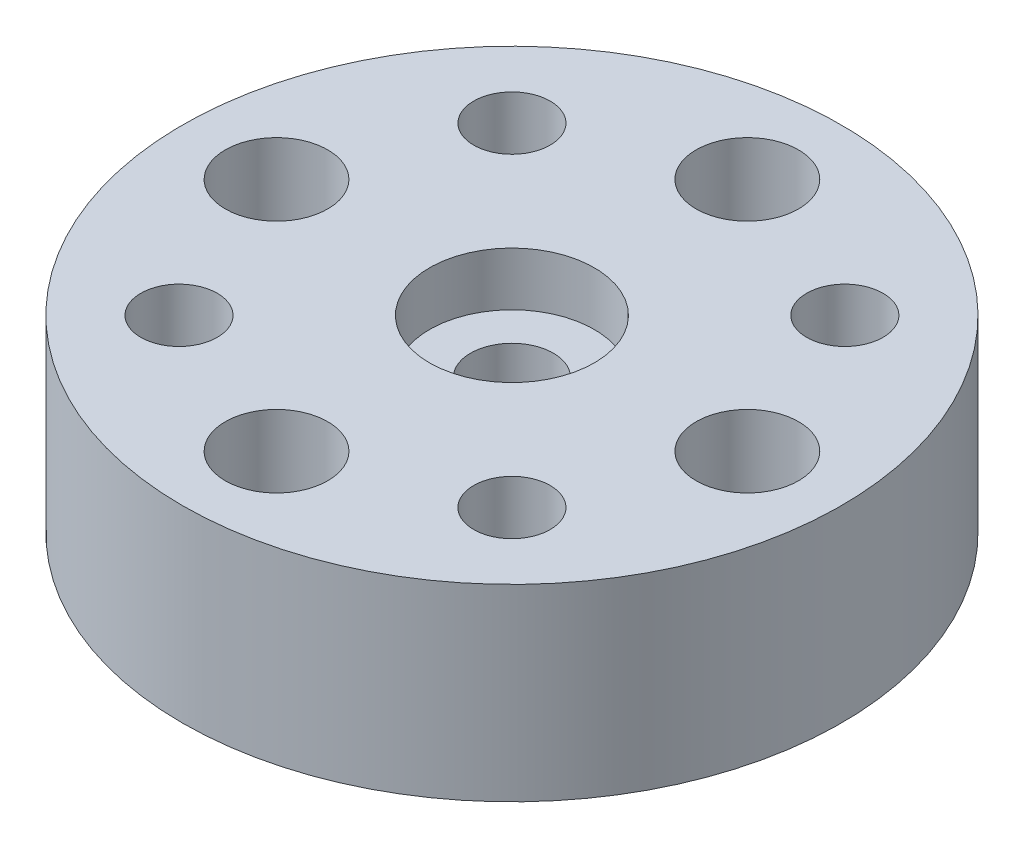
ISO-10303-21;
HEADER;
FILE_DESCRIPTION(('STEP AP214'),'2;1');
FILE_NAME('part.step','',(''),(''),'','','');
FILE_SCHEMA(('AUTOMOTIVE_DESIGN { 1 0 10303 214 1 1 1 1 }'));
ENDSEC;
DATA;
#1=APPLICATION_CONTEXT('core data for automotive mechanical design processes');
#2=APPLICATION_PROTOCOL_DEFINITION('international standard','automotive_design',2000,#1);
#3=PRODUCT_CONTEXT('',#1,'mechanical');
#4=PRODUCT('Part','Part','',(#3));
#5=PRODUCT_RELATED_PRODUCT_CATEGORY('part','',(#4));
#6=PRODUCT_DEFINITION_FORMATION('','',#4);
#7=PRODUCT_DEFINITION_CONTEXT('part definition',#1,'design');
#8=PRODUCT_DEFINITION('design','',#6,#7);
#9=PRODUCT_DEFINITION_SHAPE('','',#8);
#10=(LENGTH_UNIT() NAMED_UNIT(*) SI_UNIT(.MILLI.,.METRE.));
#11=(NAMED_UNIT(*) PLANE_ANGLE_UNIT() SI_UNIT($,.RADIAN.));
#12=(NAMED_UNIT(*) SI_UNIT($,.STERADIAN.) SOLID_ANGLE_UNIT());
#13=UNCERTAINTY_MEASURE_WITH_UNIT(LENGTH_MEASURE(1.E-05),#10,'distance_accuracy_value','');
#14=(GEOMETRIC_REPRESENTATION_CONTEXT(3) GLOBAL_UNCERTAINTY_ASSIGNED_CONTEXT((#13)) GLOBAL_UNIT_ASSIGNED_CONTEXT((#10,
#11,#12)) REPRESENTATION_CONTEXT('',''));
#15=CARTESIAN_POINT('',(0.,0.,0.));
#16=DIRECTION('',(0.,0.,1.));
#17=DIRECTION('',(1.,0.,0.));
#18=AXIS2_PLACEMENT_3D('',#15,#16,#17);
#19=CARTESIAN_POINT('',(0.,-6.35,0.));
#20=DIRECTION('',(0.,1.,0.));
#21=DIRECTION('',(0.,0.,1.));
#22=AXIS2_PLACEMENT_3D('',#19,#20,#21);
#23=CYLINDRICAL_SURFACE('',#22,11.1125);
#24=CARTESIAN_POINT('',(0.,-6.35,0.));
#25=DIRECTION('',(0.,1.,0.));
#26=DIRECTION('',(0.,0.,1.));
#27=AXIS2_PLACEMENT_3D('',#24,#25,#26);
#28=CIRCLE('',#27,11.1125);
#29=CARTESIAN_POINT('',(0.,-6.35,11.1125));
#30=VERTEX_POINT('',#29);
#31=EDGE_CURVE('E10',#30,#30,#28,.T.);
#32=ORIENTED_EDGE('',*,*,#31,.T.);
#33=EDGE_LOOP('',(#32));
#34=FACE_BOUND('',#33,.T.);
#35=CARTESIAN_POINT('',(0.,0.,0.));
#36=DIRECTION('',(0.,1.,0.));
#37=DIRECTION('',(0.,0.,1.));
#38=AXIS2_PLACEMENT_3D('',#35,#36,#37);
#39=CIRCLE('',#38,11.1125);
#40=CARTESIAN_POINT('',(0.,0.,11.1125));
#41=VERTEX_POINT('',#40);
#42=EDGE_CURVE('E31',#41,#41,#39,.T.);
#43=ORIENTED_EDGE('',*,*,#42,.F.);
#44=EDGE_LOOP('',(#43));
#45=FACE_BOUND('',#44,.T.);
#46=ADVANCED_FACE('F28',(#34,#45),#23,.T.);
#47=CARTESIAN_POINT('',(0.,-6.35,0.));
#48=DIRECTION('',(0.,1.,0.));
#49=DIRECTION('',(0.,0.,1.));
#50=AXIS2_PLACEMENT_3D('',#47,#48,#49);
#51=PLANE('',#50);
#52=CARTESIAN_POINT('',(0.,-6.35,0.));
#53=DIRECTION('',(0.,1.,0.));
#54=DIRECTION('',(0.,0.,1.));
#55=AXIS2_PLACEMENT_3D('',#52,#53,#54);
#56=CIRCLE('',#55,1.397);
#57=CARTESIAN_POINT('',(0.,-6.35,1.397));
#58=VERTEX_POINT('',#57);
#59=EDGE_CURVE('E87',#58,#58,#56,.T.);
#60=ORIENTED_EDGE('',*,*,#59,.T.);
#61=EDGE_LOOP('',(#60));
#62=FACE_BOUND('',#61,.T.);
#63=CARTESIAN_POINT('',(-5.61266007566822,-6.35,-5.61266007566822));
#64=DIRECTION('',(0.,-1.,0.));
#65=DIRECTION('',(0.,0.,-1.));
#66=AXIS2_PLACEMENT_3D('',#63,#64,#65);
#67=CIRCLE('',#66,1.28904999999999);
#68=CARTESIAN_POINT('',(-5.61266007566822,-6.35,-6.90171007566821));
#69=VERTEX_POINT('',#68);
#70=EDGE_CURVE('E84',#69,#69,#67,.T.);
#71=ORIENTED_EDGE('',*,*,#70,.F.);
#72=EDGE_LOOP('',(#71));
#73=FACE_BOUND('',#72,.T.);
#74=CARTESIAN_POINT('',(5.61266007566822,-6.35,-5.61266007566822));
#75=DIRECTION('',(0.,-1.,0.));
#76=DIRECTION('',(0.,0.,-1.));
#77=AXIS2_PLACEMENT_3D('',#74,#75,#76);
#78=CIRCLE('',#77,1.28904999999999);
#79=CARTESIAN_POINT('',(5.61266007566822,-6.35,-6.90171007566821));
#80=VERTEX_POINT('',#79);
#81=EDGE_CURVE('E78',#80,#80,#78,.T.);
#82=ORIENTED_EDGE('',*,*,#81,.F.);
#83=EDGE_LOOP('',(#82));
#84=FACE_BOUND('',#83,.T.);
#85=CARTESIAN_POINT('',(5.61266007566822,-6.35,5.61266007566822));
#86=DIRECTION('',(0.,-1.,0.));
#87=DIRECTION('',(0.,0.,-1.));
#88=AXIS2_PLACEMENT_3D('',#85,#86,#87);
#89=CIRCLE('',#88,1.28904999999999);
#90=CARTESIAN_POINT('',(5.61266007566822,-6.35,4.32361007566823));
#91=VERTEX_POINT('',#90);
#92=EDGE_CURVE('E72',#91,#91,#89,.T.);
#93=ORIENTED_EDGE('',*,*,#92,.F.);
#94=EDGE_LOOP('',(#93));
#95=FACE_BOUND('',#94,.T.);
#96=CARTESIAN_POINT('',(-5.61266007566822,-6.35,5.61266007566822));
#97=DIRECTION('',(0.,-1.,0.));
#98=DIRECTION('',(0.,0.,-1.));
#99=AXIS2_PLACEMENT_3D('',#96,#97,#98);
#100=CIRCLE('',#99,1.28904999999999);
#101=CARTESIAN_POINT('',(-5.61266007566822,-6.35,4.32361007566823));
#102=VERTEX_POINT('',#101);
#103=EDGE_CURVE('E66',#102,#102,#100,.T.);
#104=ORIENTED_EDGE('',*,*,#103,.F.);
#105=EDGE_LOOP('',(#104));
#106=FACE_BOUND('',#105,.T.);
#107=CARTESIAN_POINT('',(-7.9375,-6.35,0.));
#108=DIRECTION('',(0.,1.,0.));
#109=DIRECTION('',(0.,0.,1.));
#110=AXIS2_PLACEMENT_3D('',#107,#108,#109);
#111=CIRCLE('',#110,1.7272);
#112=CARTESIAN_POINT('',(-7.9375,-6.35,1.7272));
#113=VERTEX_POINT('',#112);
#114=EDGE_CURVE('E57',#113,#113,#111,.T.);
#115=ORIENTED_EDGE('',*,*,#114,.T.);
#116=EDGE_LOOP('',(#115));
#117=FACE_BOUND('',#116,.T.);
#118=CARTESIAN_POINT('',(0.,-6.35,-7.9375));
#119=DIRECTION('',(0.,1.,0.));
#120=DIRECTION('',(0.,0.,1.));
#121=AXIS2_PLACEMENT_3D('',#118,#119,#120);
#122=CIRCLE('',#121,1.7272);
#123=CARTESIAN_POINT('',(0.,-6.35,-6.2103));
#124=VERTEX_POINT('',#123);
#125=EDGE_CURVE('E51',#124,#124,#122,.T.);
#126=ORIENTED_EDGE('',*,*,#125,.T.);
#127=EDGE_LOOP('',(#126));
#128=FACE_BOUND('',#127,.T.);
#129=CARTESIAN_POINT('',(7.9375,-6.35,0.));
#130=DIRECTION('',(0.,1.,0.));
#131=DIRECTION('',(0.,0.,1.));
#132=AXIS2_PLACEMENT_3D('',#129,#130,#131);
#133=CIRCLE('',#132,1.7272);
#134=CARTESIAN_POINT('',(7.9375,-6.35,1.7272));
#135=VERTEX_POINT('',#134);
#136=EDGE_CURVE('E45',#135,#135,#133,.T.);
#137=ORIENTED_EDGE('',*,*,#136,.T.);
#138=EDGE_LOOP('',(#137));
#139=FACE_BOUND('',#138,.T.);
#140=CARTESIAN_POINT('',(0.,-6.35,7.9375));
#141=DIRECTION('',(0.,1.,0.));
#142=DIRECTION('',(0.,0.,1.));
#143=AXIS2_PLACEMENT_3D('',#140,#141,#142);
#144=CIRCLE('',#143,1.7272);
#145=CARTESIAN_POINT('',(0.,-6.35,9.6647));
#146=VERTEX_POINT('',#145);
#147=EDGE_CURVE('E38',#146,#146,#144,.T.);
#148=ORIENTED_EDGE('',*,*,#147,.T.);
#149=EDGE_LOOP('',(#148));
#150=FACE_BOUND('',#149,.T.);
#151=ORIENTED_EDGE('',*,*,#31,.F.);
#152=EDGE_LOOP('',(#151));
#153=FACE_BOUND('',#152,.T.);
#154=ADVANCED_FACE('F106',(#62,#73,#84,#95,#106,#117,#128,#139,#150,#153),#51,.F.);
#155=CARTESIAN_POINT('',(0.,0.,0.));
#156=DIRECTION('',(0.,1.,0.));
#157=DIRECTION('',(0.,0.,1.));
#158=AXIS2_PLACEMENT_3D('',#155,#156,#157);
#159=PLANE('',#158);
#160=CARTESIAN_POINT('',(0.,0.,0.));
#161=DIRECTION('',(0.,1.,0.));
#162=DIRECTION('',(0.,0.,1.));
#163=AXIS2_PLACEMENT_3D('',#160,#161,#162);
#164=CIRCLE('',#163,2.77876);
#165=CARTESIAN_POINT('',(0.,0.,2.77876));
#166=VERTEX_POINT('',#165);
#167=EDGE_CURVE('E96',#166,#166,#164,.T.);
#168=ORIENTED_EDGE('',*,*,#167,.F.);
#169=EDGE_LOOP('',(#168));
#170=FACE_BOUND('',#169,.T.);
#171=CARTESIAN_POINT('',(-5.61266007566822,0.,-5.61266007566822));
#172=DIRECTION('',(0.,-1.,0.));
#173=DIRECTION('',(0.,0.,-1.));
#174=AXIS2_PLACEMENT_3D('',#171,#172,#173);
#175=CIRCLE('',#174,1.28905);
#176=CARTESIAN_POINT('',(-5.61266007566822,0.,-6.90171007566822));
#177=VERTEX_POINT('',#176);
#178=EDGE_CURVE('E81',#177,#177,#175,.T.);
#179=ORIENTED_EDGE('',*,*,#178,.T.);
#180=EDGE_LOOP('',(#179));
#181=FACE_BOUND('',#180,.T.);
#182=CARTESIAN_POINT('',(5.61266007566822,0.,-5.61266007566822));
#183=DIRECTION('',(0.,-1.,0.));
#184=DIRECTION('',(0.,0.,-1.));
#185=AXIS2_PLACEMENT_3D('',#182,#183,#184);
#186=CIRCLE('',#185,1.28905);
#187=CARTESIAN_POINT('',(5.61266007566822,0.,-6.90171007566822));
#188=VERTEX_POINT('',#187);
#189=EDGE_CURVE('E75',#188,#188,#186,.T.);
#190=ORIENTED_EDGE('',*,*,#189,.T.);
#191=EDGE_LOOP('',(#190));
#192=FACE_BOUND('',#191,.T.);
#193=CARTESIAN_POINT('',(5.61266007566822,0.,5.61266007566822));
#194=DIRECTION('',(0.,-1.,0.));
#195=DIRECTION('',(0.,0.,-1.));
#196=AXIS2_PLACEMENT_3D('',#193,#194,#195);
#197=CIRCLE('',#196,1.28905);
#198=CARTESIAN_POINT('',(5.61266007566822,0.,4.32361007566822));
#199=VERTEX_POINT('',#198);
#200=EDGE_CURVE('E69',#199,#199,#197,.T.);
#201=ORIENTED_EDGE('',*,*,#200,.T.);
#202=EDGE_LOOP('',(#201));
#203=FACE_BOUND('',#202,.T.);
#204=CARTESIAN_POINT('',(-5.61266007566822,0.,5.61266007566822));
#205=DIRECTION('',(0.,-1.,0.));
#206=DIRECTION('',(0.,0.,-1.));
#207=AXIS2_PLACEMENT_3D('',#204,#205,#206);
#208=CIRCLE('',#207,1.28905);
#209=CARTESIAN_POINT('',(-5.61266007566822,0.,4.32361007566822));
#210=VERTEX_POINT('',#209);
#211=EDGE_CURVE('E63',#210,#210,#208,.T.);
#212=ORIENTED_EDGE('',*,*,#211,.T.);
#213=EDGE_LOOP('',(#212));
#214=FACE_BOUND('',#213,.T.);
#215=CARTESIAN_POINT('',(-7.9375,0.,0.));
#216=DIRECTION('',(0.,1.,0.));
#217=DIRECTION('',(0.,0.,1.));
#218=AXIS2_PLACEMENT_3D('',#215,#216,#217);
#219=CIRCLE('',#218,1.72719999999999);
#220=CARTESIAN_POINT('',(-7.9375,0.,1.72719999999999));
#221=VERTEX_POINT('',#220);
#222=EDGE_CURVE('E60',#221,#221,#219,.T.);
#223=ORIENTED_EDGE('',*,*,#222,.F.);
#224=EDGE_LOOP('',(#223));
#225=FACE_BOUND('',#224,.T.);
#226=CARTESIAN_POINT('',(0.,0.,-7.9375));
#227=DIRECTION('',(0.,1.,0.));
#228=DIRECTION('',(0.,0.,1.));
#229=AXIS2_PLACEMENT_3D('',#226,#227,#228);
#230=CIRCLE('',#229,1.72719999999999);
#231=CARTESIAN_POINT('',(0.,0.,-6.21030000000001));
#232=VERTEX_POINT('',#231);
#233=EDGE_CURVE('E54',#232,#232,#230,.T.);
#234=ORIENTED_EDGE('',*,*,#233,.F.);
#235=EDGE_LOOP('',(#234));
#236=FACE_BOUND('',#235,.T.);
#237=CARTESIAN_POINT('',(7.9375,0.,0.));
#238=DIRECTION('',(0.,1.,0.));
#239=DIRECTION('',(0.,0.,1.));
#240=AXIS2_PLACEMENT_3D('',#237,#238,#239);
#241=CIRCLE('',#240,1.72719999999999);
#242=CARTESIAN_POINT('',(7.9375,0.,1.72719999999999));
#243=VERTEX_POINT('',#242);
#244=EDGE_CURVE('E48',#243,#243,#241,.T.);
#245=ORIENTED_EDGE('',*,*,#244,.F.);
#246=EDGE_LOOP('',(#245));
#247=FACE_BOUND('',#246,.T.);
#248=CARTESIAN_POINT('',(0.,0.,7.9375));
#249=DIRECTION('',(0.,1.,0.));
#250=DIRECTION('',(0.,0.,1.));
#251=AXIS2_PLACEMENT_3D('',#248,#249,#250);
#252=CIRCLE('',#251,1.72719999999999);
#253=CARTESIAN_POINT('',(0.,0.,9.66469999999999));
#254=VERTEX_POINT('',#253);
#255=EDGE_CURVE('E42',#254,#254,#252,.T.);
#256=ORIENTED_EDGE('',*,*,#255,.F.);
#257=EDGE_LOOP('',(#256));
#258=FACE_BOUND('',#257,.T.);
#259=ORIENTED_EDGE('',*,*,#42,.T.);
#260=EDGE_LOOP('',(#259));
#261=FACE_BOUND('',#260,.T.);
#262=ADVANCED_FACE('F102',(#170,#181,#192,#203,#214,#225,#236,#247,#258,#261),#159,.T.);
#263=CARTESIAN_POINT('',(0.,0.,7.9375));
#264=DIRECTION('',(0.,1.,0.));
#265=DIRECTION('',(0.,0.,1.));
#266=AXIS2_PLACEMENT_3D('',#263,#264,#265);
#267=CYLINDRICAL_SURFACE('',#266,1.72719999999999);
#268=ORIENTED_EDGE('',*,*,#147,.F.);
#269=EDGE_LOOP('',(#268));
#270=FACE_BOUND('',#269,.T.);
#271=ORIENTED_EDGE('',*,*,#255,.T.);
#272=EDGE_LOOP('',(#271));
#273=FACE_BOUND('',#272,.T.);
#274=ADVANCED_FACE('F105',(#270,#273),#267,.F.);
#275=CARTESIAN_POINT('',(7.9375,0.,0.));
#276=DIRECTION('',(0.,1.,0.));
#277=DIRECTION('',(0.,0.,1.));
#278=AXIS2_PLACEMENT_3D('',#275,#276,#277);
#279=CYLINDRICAL_SURFACE('',#278,1.72719999999999);
#280=ORIENTED_EDGE('',*,*,#136,.F.);
#281=EDGE_LOOP('',(#280));
#282=FACE_BOUND('',#281,.T.);
#283=ORIENTED_EDGE('',*,*,#244,.T.);
#284=EDGE_LOOP('',(#283));
#285=FACE_BOUND('',#284,.T.);
#286=ADVANCED_FACE('F137',(#282,#285),#279,.F.);
#287=CARTESIAN_POINT('',(0.,0.,-7.9375));
#288=DIRECTION('',(0.,1.,0.));
#289=DIRECTION('',(0.,0.,1.));
#290=AXIS2_PLACEMENT_3D('',#287,#288,#289);
#291=CYLINDRICAL_SURFACE('',#290,1.72719999999999);
#292=ORIENTED_EDGE('',*,*,#125,.F.);
#293=EDGE_LOOP('',(#292));
#294=FACE_BOUND('',#293,.T.);
#295=ORIENTED_EDGE('',*,*,#233,.T.);
#296=EDGE_LOOP('',(#295));
#297=FACE_BOUND('',#296,.T.);
#298=ADVANCED_FACE('F141',(#294,#297),#291,.F.);
#299=CARTESIAN_POINT('',(-7.9375,0.,0.));
#300=DIRECTION('',(0.,1.,0.));
#301=DIRECTION('',(0.,0.,1.));
#302=AXIS2_PLACEMENT_3D('',#299,#300,#301);
#303=CYLINDRICAL_SURFACE('',#302,1.72719999999999);
#304=ORIENTED_EDGE('',*,*,#114,.F.);
#305=EDGE_LOOP('',(#304));
#306=FACE_BOUND('',#305,.T.);
#307=ORIENTED_EDGE('',*,*,#222,.T.);
#308=EDGE_LOOP('',(#307));
#309=FACE_BOUND('',#308,.T.);
#310=ADVANCED_FACE('F145',(#306,#309),#303,.F.);
#311=CARTESIAN_POINT('',(-5.61266007566822,-6.35,5.61266007566822));
#312=DIRECTION('',(0.,-1.,0.));
#313=DIRECTION('',(0.,0.,-1.));
#314=AXIS2_PLACEMENT_3D('',#311,#312,#313);
#315=CYLINDRICAL_SURFACE('',#314,1.28904999999999);
#316=ORIENTED_EDGE('',*,*,#211,.F.);
#317=EDGE_LOOP('',(#316));
#318=FACE_BOUND('',#317,.T.);
#319=ORIENTED_EDGE('',*,*,#103,.T.);
#320=EDGE_LOOP('',(#319));
#321=FACE_BOUND('',#320,.T.);
#322=ADVANCED_FACE('F149',(#318,#321),#315,.F.);
#323=CARTESIAN_POINT('',(5.61266007566822,-6.35,5.61266007566822));
#324=DIRECTION('',(0.,-1.,0.));
#325=DIRECTION('',(0.,0.,-1.));
#326=AXIS2_PLACEMENT_3D('',#323,#324,#325);
#327=CYLINDRICAL_SURFACE('',#326,1.28904999999999);
#328=ORIENTED_EDGE('',*,*,#200,.F.);
#329=EDGE_LOOP('',(#328));
#330=FACE_BOUND('',#329,.T.);
#331=ORIENTED_EDGE('',*,*,#92,.T.);
#332=EDGE_LOOP('',(#331));
#333=FACE_BOUND('',#332,.T.);
#334=ADVANCED_FACE('F153',(#330,#333),#327,.F.);
#335=CARTESIAN_POINT('',(5.61266007566822,-6.35,-5.61266007566822));
#336=DIRECTION('',(0.,-1.,0.));
#337=DIRECTION('',(0.,0.,-1.));
#338=AXIS2_PLACEMENT_3D('',#335,#336,#337);
#339=CYLINDRICAL_SURFACE('',#338,1.28904999999999);
#340=ORIENTED_EDGE('',*,*,#189,.F.);
#341=EDGE_LOOP('',(#340));
#342=FACE_BOUND('',#341,.T.);
#343=ORIENTED_EDGE('',*,*,#81,.T.);
#344=EDGE_LOOP('',(#343));
#345=FACE_BOUND('',#344,.T.);
#346=ADVANCED_FACE('F157',(#342,#345),#339,.F.);
#347=CARTESIAN_POINT('',(-5.61266007566822,-6.35,-5.61266007566822));
#348=DIRECTION('',(0.,-1.,0.));
#349=DIRECTION('',(0.,0.,-1.));
#350=AXIS2_PLACEMENT_3D('',#347,#348,#349);
#351=CYLINDRICAL_SURFACE('',#350,1.28904999999999);
#352=ORIENTED_EDGE('',*,*,#178,.F.);
#353=EDGE_LOOP('',(#352));
#354=FACE_BOUND('',#353,.T.);
#355=ORIENTED_EDGE('',*,*,#70,.T.);
#356=EDGE_LOOP('',(#355));
#357=FACE_BOUND('',#356,.T.);
#358=ADVANCED_FACE('F161',(#354,#357),#351,.F.);
#359=CARTESIAN_POINT('',(0.,0.,0.));
#360=DIRECTION('',(0.,1.,0.));
#361=DIRECTION('',(0.,0.,1.));
#362=AXIS2_PLACEMENT_3D('',#359,#360,#361);
#363=CYLINDRICAL_SURFACE('',#362,1.397);
#364=ORIENTED_EDGE('',*,*,#59,.F.);
#365=EDGE_LOOP('',(#364));
#366=FACE_BOUND('',#365,.T.);
#367=CARTESIAN_POINT('',(0.,-1.8034,0.));
#368=DIRECTION('',(0.,1.,0.));
#369=DIRECTION('',(0.,0.,1.));
#370=AXIS2_PLACEMENT_3D('',#367,#368,#369);
#371=CIRCLE('',#370,1.397);
#372=CARTESIAN_POINT('',(0.,-1.8034,1.397));
#373=VERTEX_POINT('',#372);
#374=EDGE_CURVE('E90',#373,#373,#371,.T.);
#375=ORIENTED_EDGE('',*,*,#374,.T.);
#376=EDGE_LOOP('',(#375));
#377=FACE_BOUND('',#376,.T.);
#378=ADVANCED_FACE('F165',(#366,#377),#363,.F.);
#379=CARTESIAN_POINT('',(1.397,-1.8034,0.));
#380=DIRECTION('',(0.,-1.,0.));
#381=DIRECTION('',(0.,0.,-1.));
#382=AXIS2_PLACEMENT_3D('',#379,#380,#381);
#383=PLANE('',#382);
#384=ORIENTED_EDGE('',*,*,#374,.F.);
#385=EDGE_LOOP('',(#384));
#386=FACE_BOUND('',#385,.T.);
#387=CARTESIAN_POINT('',(0.,-1.8034,0.));
#388=DIRECTION('',(0.,1.,0.));
#389=DIRECTION('',(0.,0.,1.));
#390=AXIS2_PLACEMENT_3D('',#387,#388,#389);
#391=CIRCLE('',#390,2.77876);
#392=CARTESIAN_POINT('',(0.,-1.8034,2.77876));
#393=VERTEX_POINT('',#392);
#394=EDGE_CURVE('E93',#393,#393,#391,.T.);
#395=ORIENTED_EDGE('',*,*,#394,.T.);
#396=EDGE_LOOP('',(#395));
#397=FACE_BOUND('',#396,.T.);
#398=ADVANCED_FACE('F169',(#386,#397),#383,.F.);
#399=CARTESIAN_POINT('',(0.,0.,0.));
#400=DIRECTION('',(0.,1.,0.));
#401=DIRECTION('',(0.,0.,1.));
#402=AXIS2_PLACEMENT_3D('',#399,#400,#401);
#403=CYLINDRICAL_SURFACE('',#402,2.77876);
#404=ORIENTED_EDGE('',*,*,#394,.F.);
#405=EDGE_LOOP('',(#404));
#406=FACE_BOUND('',#405,.T.);
#407=ORIENTED_EDGE('',*,*,#167,.T.);
#408=EDGE_LOOP('',(#407));
#409=FACE_BOUND('',#408,.T.);
#410=ADVANCED_FACE('F100',(#406,#409),#403,.F.);
#411=CLOSED_SHELL('',(#46,#154,#262,#274,#286,#298,#310,#322,#334,#346,#358,#378,#398,#410));
#412=MANIFOLD_SOLID_BREP('B2',#411);
#413=ADVANCED_BREP_SHAPE_REPRESENTATION('',(#18,#412),#14);
#414=SHAPE_DEFINITION_REPRESENTATION(#9,#413);
ENDSEC;
END-ISO-10303-21;
